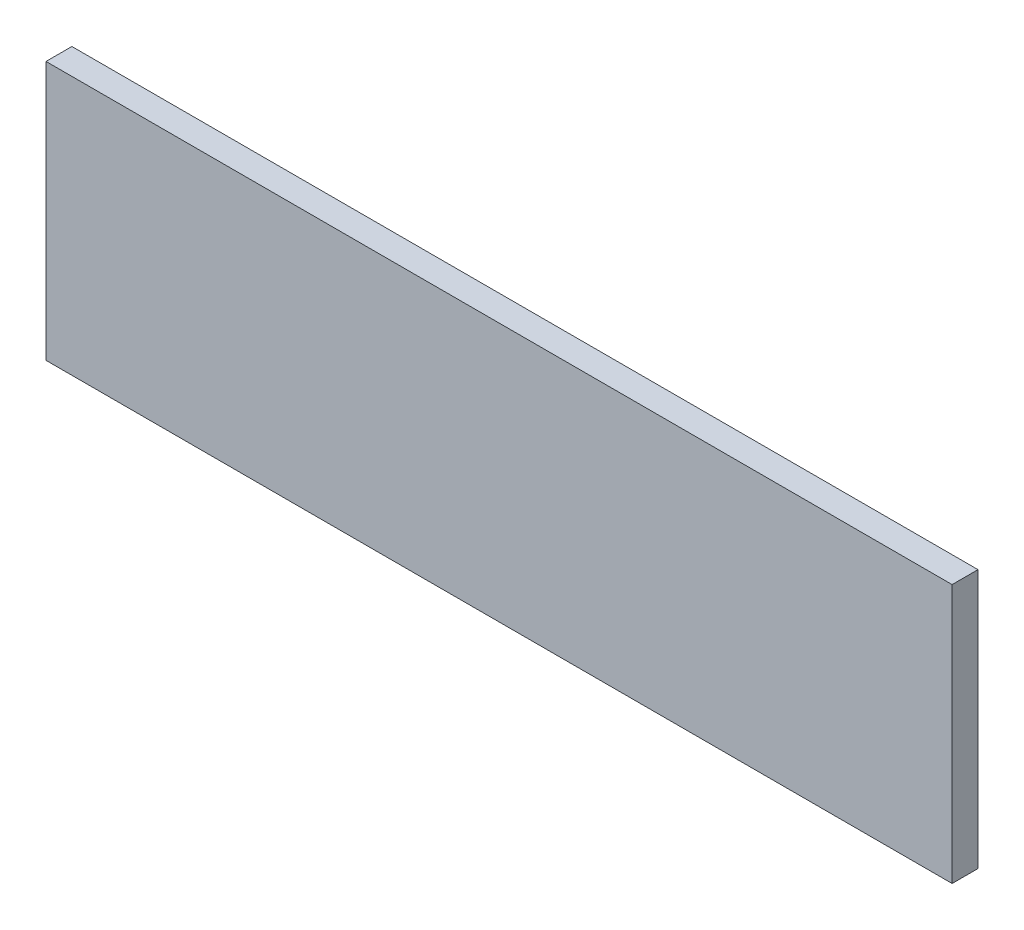
ISO-10303-21;
HEADER;
FILE_DESCRIPTION(('STEP AP214'),'2;1');
FILE_NAME('part.step','',(''),(''),'','','');
FILE_SCHEMA(('AUTOMOTIVE_DESIGN { 1 0 10303 214 1 1 1 1 }'));
ENDSEC;
DATA;
#1=APPLICATION_CONTEXT('core data for automotive mechanical design processes');
#2=APPLICATION_PROTOCOL_DEFINITION('international standard','automotive_design',2000,#1);
#3=PRODUCT_CONTEXT('',#1,'mechanical');
#4=PRODUCT('Part','Part','',(#3));
#5=PRODUCT_RELATED_PRODUCT_CATEGORY('part','',(#4));
#6=PRODUCT_DEFINITION_FORMATION('','',#4);
#7=PRODUCT_DEFINITION_CONTEXT('part definition',#1,'design');
#8=PRODUCT_DEFINITION('design','',#6,#7);
#9=PRODUCT_DEFINITION_SHAPE('','',#8);
#10=(LENGTH_UNIT() NAMED_UNIT(*) SI_UNIT(.MILLI.,.METRE.));
#11=(NAMED_UNIT(*) PLANE_ANGLE_UNIT() SI_UNIT($,.RADIAN.));
#12=(NAMED_UNIT(*) SI_UNIT($,.STERADIAN.) SOLID_ANGLE_UNIT());
#13=UNCERTAINTY_MEASURE_WITH_UNIT(LENGTH_MEASURE(1.E-05),#10,'distance_accuracy_value','');
#14=(GEOMETRIC_REPRESENTATION_CONTEXT(3) GLOBAL_UNCERTAINTY_ASSIGNED_CONTEXT((#13)) GLOBAL_UNIT_ASSIGNED_CONTEXT((#10,
#11,#12)) REPRESENTATION_CONTEXT('',''));
#15=CARTESIAN_POINT('',(0.,0.,0.));
#16=DIRECTION('',(0.,0.,1.));
#17=DIRECTION('',(1.,0.,0.));
#18=AXIS2_PLACEMENT_3D('',#15,#16,#17);
#19=CARTESIAN_POINT('',(0.,0.,2.));
#20=DIRECTION('',(1.,0.,0.));
#21=DIRECTION('',(0.,1.,0.));
#22=AXIS2_PLACEMENT_3D('',#19,#20,#21);
#23=PLANE('',#22);
#24=DIRECTION('',(0.,-1.,0.));
#25=VECTOR('',#24,1.);
#26=CARTESIAN_POINT('',(0.,0.,0.));
#27=LINE('',#26,#25);
#28=CARTESIAN_POINT('',(0.,0.,0.));
#29=VERTEX_POINT('',#28);
#30=CARTESIAN_POINT('',(0.,-20.,0.));
#31=VERTEX_POINT('',#30);
#32=EDGE_CURVE('E100',#29,#31,#27,.T.);
#33=ORIENTED_EDGE('',*,*,#32,.T.);
#34=DIRECTION('',(0.,0.,-1.));
#35=VECTOR('',#34,1.);
#36=CARTESIAN_POINT('',(0.,-20.,2.));
#37=LINE('',#36,#35);
#38=CARTESIAN_POINT('',(0.,-20.,2.));
#39=VERTEX_POINT('',#38);
#40=EDGE_CURVE('E11',#39,#31,#37,.T.);
#41=ORIENTED_EDGE('',*,*,#40,.F.);
#42=DIRECTION('',(0.,-1.,0.));
#43=VECTOR('',#42,1.);
#44=CARTESIAN_POINT('',(0.,0.,2.));
#45=LINE('',#44,#43);
#46=CARTESIAN_POINT('',(0.,0.,2.));
#47=VERTEX_POINT('',#46);
#48=EDGE_CURVE('E88',#47,#39,#45,.T.);
#49=ORIENTED_EDGE('',*,*,#48,.F.);
#50=DIRECTION('',(0.,0.,-1.));
#51=VECTOR('',#50,1.);
#52=CARTESIAN_POINT('',(0.,0.,2.));
#53=LINE('',#52,#51);
#54=EDGE_CURVE('E96',#47,#29,#53,.T.);
#55=ORIENTED_EDGE('',*,*,#54,.T.);
#56=EDGE_LOOP('',(#33,#41,#49,#55));
#57=FACE_BOUND('',#56,.T.);
#58=ADVANCED_FACE('F37',(#57),#23,.F.);
#59=CARTESIAN_POINT('',(0.,-20.,2.));
#60=DIRECTION('',(0.,1.,0.));
#61=DIRECTION('',(0.,0.,1.));
#62=AXIS2_PLACEMENT_3D('',#59,#60,#61);
#63=PLANE('',#62);
#64=DIRECTION('',(1.,0.,0.));
#65=VECTOR('',#64,1.);
#66=CARTESIAN_POINT('',(0.,-20.,0.));
#67=LINE('',#66,#65);
#68=CARTESIAN_POINT('',(70.,-20.,0.));
#69=VERTEX_POINT('',#68);
#70=EDGE_CURVE('E92',#31,#69,#67,.T.);
#71=ORIENTED_EDGE('',*,*,#70,.T.);
#72=DIRECTION('',(0.,0.,-1.));
#73=VECTOR('',#72,1.);
#74=CARTESIAN_POINT('',(70.,-20.,2.));
#75=LINE('',#74,#73);
#76=CARTESIAN_POINT('',(70.,-20.,2.));
#77=VERTEX_POINT('',#76);
#78=EDGE_CURVE('E45',#77,#69,#75,.T.);
#79=ORIENTED_EDGE('',*,*,#78,.F.);
#80=DIRECTION('',(1.,0.,0.));
#81=VECTOR('',#80,1.);
#82=CARTESIAN_POINT('',(0.,-20.,2.));
#83=LINE('',#82,#81);
#84=EDGE_CURVE('E83',#39,#77,#83,.T.);
#85=ORIENTED_EDGE('',*,*,#84,.F.);
#86=ORIENTED_EDGE('',*,*,#40,.T.);
#87=EDGE_LOOP('',(#71,#79,#85,#86));
#88=FACE_BOUND('',#87,.T.);
#89=ADVANCED_FACE('F91',(#88),#63,.F.);
#90=CARTESIAN_POINT('',(70.,0.,2.));
#91=DIRECTION('',(-1.,0.,0.));
#92=DIRECTION('',(0.,0.,1.));
#93=AXIS2_PLACEMENT_3D('',#90,#91,#92);
#94=PLANE('',#93);
#95=DIRECTION('',(0.,1.,0.));
#96=VECTOR('',#95,1.);
#97=CARTESIAN_POINT('',(70.,0.,0.));
#98=LINE('',#97,#96);
#99=CARTESIAN_POINT('',(70.,0.,0.));
#100=VERTEX_POINT('',#99);
#101=EDGE_CURVE('E70',#69,#100,#98,.T.);
#102=ORIENTED_EDGE('',*,*,#101,.T.);
#103=DIRECTION('',(0.,0.,-1.));
#104=VECTOR('',#103,1.);
#105=CARTESIAN_POINT('',(70.,0.,2.));
#106=LINE('',#105,#104);
#107=CARTESIAN_POINT('',(70.,0.,2.));
#108=VERTEX_POINT('',#107);
#109=EDGE_CURVE('E93',#108,#100,#106,.T.);
#110=ORIENTED_EDGE('',*,*,#109,.F.);
#111=DIRECTION('',(0.,1.,0.));
#112=VECTOR('',#111,1.);
#113=CARTESIAN_POINT('',(70.,0.,2.));
#114=LINE('',#113,#112);
#115=EDGE_CURVE('E86',#77,#108,#114,.T.);
#116=ORIENTED_EDGE('',*,*,#115,.F.);
#117=ORIENTED_EDGE('',*,*,#78,.T.);
#118=EDGE_LOOP('',(#102,#110,#116,#117));
#119=FACE_BOUND('',#118,.T.);
#120=ADVANCED_FACE('F94',(#119),#94,.F.);
#121=CARTESIAN_POINT('',(0.,0.,2.));
#122=DIRECTION('',(0.,-1.,0.));
#123=DIRECTION('',(0.,0.,-1.));
#124=AXIS2_PLACEMENT_3D('',#121,#122,#123);
#125=PLANE('',#124);
#126=DIRECTION('',(-1.,0.,0.));
#127=VECTOR('',#126,1.);
#128=CARTESIAN_POINT('',(0.,0.,0.));
#129=LINE('',#128,#127);
#130=EDGE_CURVE('E76',#100,#29,#129,.T.);
#131=ORIENTED_EDGE('',*,*,#130,.T.);
#132=ORIENTED_EDGE('',*,*,#54,.F.);
#133=DIRECTION('',(-1.,0.,0.));
#134=VECTOR('',#133,1.);
#135=CARTESIAN_POINT('',(0.,0.,2.));
#136=LINE('',#135,#134);
#137=EDGE_CURVE('E53',#108,#47,#136,.T.);
#138=ORIENTED_EDGE('',*,*,#137,.F.);
#139=ORIENTED_EDGE('',*,*,#109,.T.);
#140=EDGE_LOOP('',(#131,#132,#138,#139));
#141=FACE_BOUND('',#140,.T.);
#142=ADVANCED_FACE('F107',(#141),#125,.F.);
#143=CARTESIAN_POINT('',(0.,0.,2.));
#144=DIRECTION('',(0.,0.,1.));
#145=DIRECTION('',(1.,0.,0.));
#146=AXIS2_PLACEMENT_3D('',#143,#144,#145);
#147=PLANE('',#146);
#148=ORIENTED_EDGE('',*,*,#48,.T.);
#149=ORIENTED_EDGE('',*,*,#84,.T.);
#150=ORIENTED_EDGE('',*,*,#115,.T.);
#151=ORIENTED_EDGE('',*,*,#137,.T.);
#152=EDGE_LOOP('',(#148,#149,#150,#151));
#153=FACE_BOUND('',#152,.T.);
#154=ADVANCED_FACE('F84',(#153),#147,.T.);
#155=CARTESIAN_POINT('',(0.,0.,0.));
#156=DIRECTION('',(0.,0.,1.));
#157=DIRECTION('',(1.,0.,0.));
#158=AXIS2_PLACEMENT_3D('',#155,#156,#157);
#159=PLANE('',#158);
#160=ORIENTED_EDGE('',*,*,#32,.F.);
#161=ORIENTED_EDGE('',*,*,#130,.F.);
#162=ORIENTED_EDGE('',*,*,#101,.F.);
#163=ORIENTED_EDGE('',*,*,#70,.F.);
#164=EDGE_LOOP('',(#160,#161,#162,#163));
#165=FACE_BOUND('',#164,.T.);
#166=ADVANCED_FACE('F110',(#165),#159,.F.);
#167=CLOSED_SHELL('',(#58,#89,#120,#142,#154,#166));
#168=MANIFOLD_SOLID_BREP('B2',#167);
#169=ADVANCED_BREP_SHAPE_REPRESENTATION('',(#18,#168),#14);
#170=SHAPE_DEFINITION_REPRESENTATION(#9,#169);
ENDSEC;
END-ISO-10303-21;
